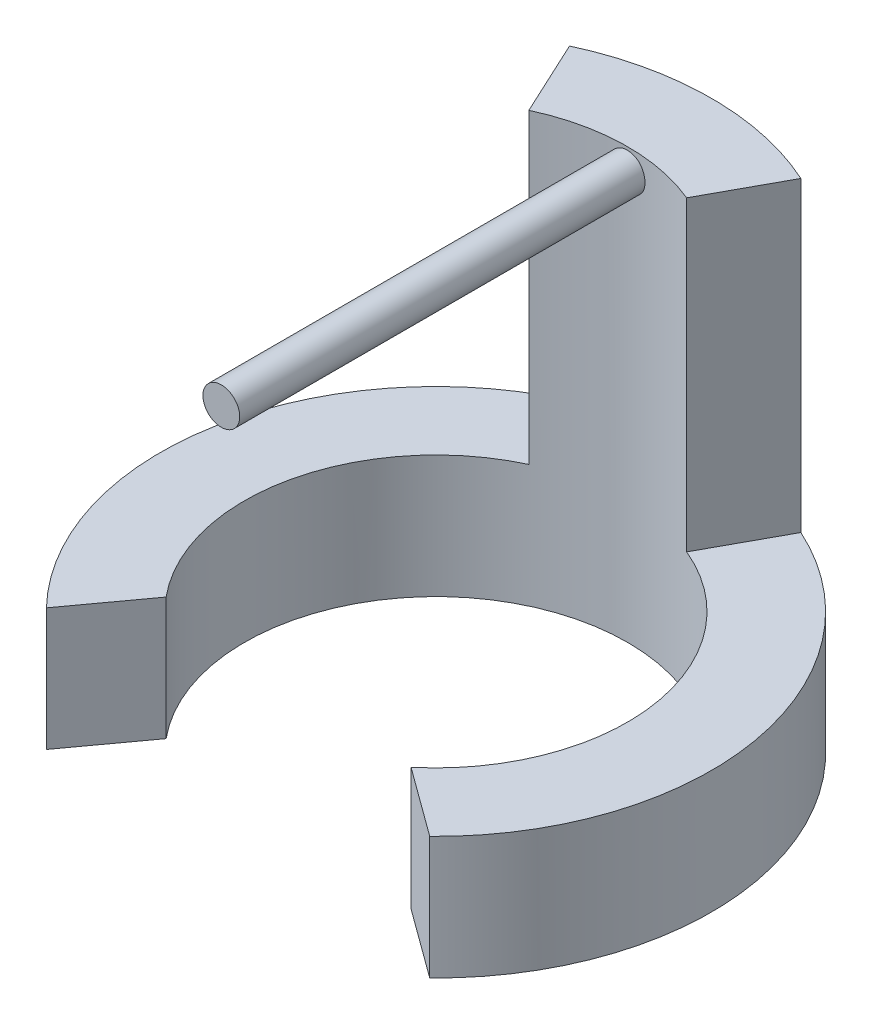
ISO-10303-21;
HEADER;
FILE_DESCRIPTION(('STEP AP214'),'2;1');
FILE_NAME('part.step','',(''),(''),'','','');
FILE_SCHEMA(('AUTOMOTIVE_DESIGN { 1 0 10303 214 1 1 1 1 }'));
ENDSEC;
DATA;
#1=APPLICATION_CONTEXT('core data for automotive mechanical design processes');
#2=APPLICATION_PROTOCOL_DEFINITION('international standard','automotive_design',2000,#1);
#3=PRODUCT_CONTEXT('',#1,'mechanical');
#4=PRODUCT('Part','Part','',(#3));
#5=PRODUCT_RELATED_PRODUCT_CATEGORY('part','',(#4));
#6=PRODUCT_DEFINITION_FORMATION('','',#4);
#7=PRODUCT_DEFINITION_CONTEXT('part definition',#1,'design');
#8=PRODUCT_DEFINITION('design','',#6,#7);
#9=PRODUCT_DEFINITION_SHAPE('','',#8);
#10=(LENGTH_UNIT() NAMED_UNIT(*) SI_UNIT(.MILLI.,.METRE.));
#11=(NAMED_UNIT(*) PLANE_ANGLE_UNIT() SI_UNIT($,.RADIAN.));
#12=(NAMED_UNIT(*) SI_UNIT($,.STERADIAN.) SOLID_ANGLE_UNIT());
#13=UNCERTAINTY_MEASURE_WITH_UNIT(LENGTH_MEASURE(1.E-05),#10,'distance_accuracy_value','');
#14=(GEOMETRIC_REPRESENTATION_CONTEXT(3) GLOBAL_UNCERTAINTY_ASSIGNED_CONTEXT((#13)) GLOBAL_UNIT_ASSIGNED_CONTEXT((#10,
#11,#12)) REPRESENTATION_CONTEXT('',''));
#15=CARTESIAN_POINT('',(0.,0.,0.));
#16=DIRECTION('',(0.,0.,1.));
#17=DIRECTION('',(1.,0.,0.));
#18=AXIS2_PLACEMENT_3D('',#15,#16,#17);
#19=CARTESIAN_POINT('',(0.,33.782,-17.78));
#20=DIRECTION('',(0.,0.,1.));
#21=DIRECTION('',(1.,0.,0.));
#22=AXIS2_PLACEMENT_3D('',#19,#20,#21);
#23=CYLINDRICAL_SURFACE('',#22,1.524);
#24=CARTESIAN_POINT('',(0.,33.782,-17.78));
#25=DIRECTION('',(0.,0.,1.));
#26=DIRECTION('',(1.,0.,0.));
#27=AXIS2_PLACEMENT_3D('',#24,#25,#26);
#28=CIRCLE('',#27,1.524);
#29=CARTESIAN_POINT('',(1.524,33.782,-17.78));
#30=VERTEX_POINT('',#29);
#31=EDGE_CURVE('E11',#30,#30,#28,.T.);
#32=ORIENTED_EDGE('',*,*,#31,.T.);
#33=EDGE_LOOP('',(#32));
#34=FACE_BOUND('',#33,.T.);
#35=CARTESIAN_POINT('',(0.,33.782,17.78));
#36=DIRECTION('',(0.,0.,1.));
#37=DIRECTION('',(1.,0.,0.));
#38=AXIS2_PLACEMENT_3D('',#35,#36,#37);
#39=CIRCLE('',#38,1.524);
#40=CARTESIAN_POINT('',(1.524,33.782,17.78));
#41=VERTEX_POINT('',#40);
#42=EDGE_CURVE('E47',#41,#41,#39,.T.);
#43=ORIENTED_EDGE('',*,*,#42,.F.);
#44=EDGE_LOOP('',(#43));
#45=FACE_BOUND('',#44,.T.);
#46=ADVANCED_FACE('F41',(#34,#45),#23,.T.);
#47=CARTESIAN_POINT('',(0.,33.782,-17.78));
#48=DIRECTION('',(0.,0.,1.));
#49=DIRECTION('',(1.,0.,0.));
#50=AXIS2_PLACEMENT_3D('',#47,#48,#49);
#51=PLANE('',#50);
#52=ORIENTED_EDGE('',*,*,#31,.F.);
#53=EDGE_LOOP('',(#52));
#54=FACE_BOUND('',#53,.T.);
#55=ADVANCED_FACE('F56',(#54),#51,.F.);
#56=CARTESIAN_POINT('',(0.,33.782,17.78));
#57=DIRECTION('',(0.,0.,1.));
#58=DIRECTION('',(1.,0.,0.));
#59=AXIS2_PLACEMENT_3D('',#56,#57,#58);
#60=PLANE('',#59);
#61=ORIENTED_EDGE('',*,*,#42,.T.);
#62=EDGE_LOOP('',(#61));
#63=FACE_BOUND('',#62,.T.);
#64=ADVANCED_FACE('F53',(#63),#60,.T.);
#65=CLOSED_SHELL('',(#46,#55,#64));
#66=MANIFOLD_SOLID_BREP('B2',#65);
#67=CARTESIAN_POINT('',(0.,10.16,0.));
#68=DIRECTION('',(0.,1.,0.));
#69=DIRECTION('',(0.,0.,1.));
#70=AXIS2_PLACEMENT_3D('',#67,#68,#69);
#71=PLANE('',#70);
#72=DIRECTION('',(0.478997940383558,0.,-0.877816024636318));
#73=VECTOR('',#72,1.);
#74=CARTESIAN_POINT('',(9.45080087432411,10.16,-20.7705174006347));
#75=LINE('',#74,#73);
#76=CARTESIAN_POINT('',(6.11175472555873,10.16,-14.6513507628003));
#77=VERTEX_POINT('',#76);
#78=CARTESIAN_POINT('',(9.45080087432412,10.16,-20.7705174006347));
#79=VERTEX_POINT('',#78);
#80=EDGE_CURVE('E168',#77,#79,#75,.T.);
#81=ORIENTED_EDGE('',*,*,#80,.F.);
#82=CARTESIAN_POINT('',(0.,10.16,0.));
#83=DIRECTION('',(0.,-1.,0.));
#84=DIRECTION('',(0.,0.,1.));
#85=AXIS2_PLACEMENT_3D('',#82,#83,#84);
#86=CIRCLE('',#85,15.875);
#87=CARTESIAN_POINT('',(10.1444376507506,10.16,12.2108971721997));
#88=VERTEX_POINT('',#87);
#89=EDGE_CURVE('E200',#77,#88,#86,.T.);
#90=ORIENTED_EDGE('',*,*,#89,.T.);
#91=DIRECTION('',(0.807796803399362,0.,0.589461045716994));
#92=VECTOR('',#91,1.);
#93=CARTESIAN_POINT('',(10.1444376507506,10.16,12.2108971721997));
#94=LINE('',#93,#92);
#95=CARTESIAN_POINT('',(15.875,10.16,16.3925716486522));
#96=VERTEX_POINT('',#95);
#97=EDGE_CURVE('E196',#88,#96,#94,.T.);
#98=ORIENTED_EDGE('',*,*,#97,.T.);
#99=CARTESIAN_POINT('',(0.,10.16,0.));
#100=DIRECTION('',(0.,1.,0.));
#101=DIRECTION('',(0.,0.,1.));
#102=AXIS2_PLACEMENT_3D('',#99,#100,#101);
#103=CIRCLE('',#102,22.8195536822304);
#104=EDGE_CURVE('E107',#96,#79,#103,.T.);
#105=ORIENTED_EDGE('',*,*,#104,.T.);
#106=EDGE_LOOP('',(#81,#90,#98,#105));
#107=FACE_BOUND('',#106,.T.);
#108=ADVANCED_FACE('F82',(#107),#71,.T.);
#109=CARTESIAN_POINT('',(0.,10.16,0.));
#110=DIRECTION('',(0.,-1.,0.));
#111=DIRECTION('',(0.,0.,-1.));
#112=AXIS2_PLACEMENT_3D('',#109,#110,#111);
#113=CYLINDRICAL_SURFACE('',#112,15.875);
#114=CARTESIAN_POINT('',(0.,0.,0.));
#115=DIRECTION('',(0.,-1.,0.));
#116=DIRECTION('',(0.,0.,1.));
#117=AXIS2_PLACEMENT_3D('',#114,#115,#116);
#118=CIRCLE('',#117,15.875);
#119=CARTESIAN_POINT('',(-12.2108971721997,0.,10.1444376507506));
#120=VERTEX_POINT('',#119);
#121=CARTESIAN_POINT('',(10.1444376507506,0.,12.2108971721997));
#122=VERTEX_POINT('',#121);
#123=EDGE_CURVE('E173',#120,#122,#118,.T.);
#124=ORIENTED_EDGE('',*,*,#123,.T.);
#125=DIRECTION('',(0.,-1.,0.));
#126=VECTOR('',#125,1.);
#127=CARTESIAN_POINT('',(10.1444376507506,10.16,12.2108971721997));
#128=LINE('',#127,#126);
#129=EDGE_CURVE('E39',#88,#122,#128,.T.);
#130=ORIENTED_EDGE('',*,*,#129,.F.);
#131=ORIENTED_EDGE('',*,*,#89,.F.);
#132=DIRECTION('',(0.,-1.,0.));
#133=VECTOR('',#132,1.);
#134=CARTESIAN_POINT('',(6.11175472555873,35.56,-14.6513507628003));
#135=LINE('',#134,#133);
#136=CARTESIAN_POINT('',(6.11175472555873,35.56,-14.6513507628003));
#137=VERTEX_POINT('',#136);
#138=EDGE_CURVE('E178',#137,#77,#135,.T.);
#139=ORIENTED_EDGE('',*,*,#138,.F.);
#140=CARTESIAN_POINT('',(0.,35.56,0.));
#141=DIRECTION('',(0.,-1.,0.));
#142=DIRECTION('',(0.,0.,-1.));
#143=AXIS2_PLACEMENT_3D('',#140,#141,#142);
#144=CIRCLE('',#143,15.875);
#145=CARTESIAN_POINT('',(-6.698472134053,35.56,-14.3925708637934));
#146=VERTEX_POINT('',#145);
#147=EDGE_CURVE('E158',#146,#137,#144,.T.);
#148=ORIENTED_EDGE('',*,*,#147,.F.);
#149=DIRECTION('',(0.,-1.,0.));
#150=VECTOR('',#149,1.);
#151=CARTESIAN_POINT('',(-6.698472134053,35.56,-14.3925708637934));
#152=LINE('',#151,#150);
#153=CARTESIAN_POINT('',(-6.698472134053,10.16,-14.3925708637934));
#154=VERTEX_POINT('',#153);
#155=EDGE_CURVE('E155',#146,#154,#152,.T.);
#156=ORIENTED_EDGE('',*,*,#155,.T.);
#157=CARTESIAN_POINT('',(-12.2108971721997,10.16,10.1444376507506));
#158=VERTEX_POINT('',#157);
#159=EDGE_CURVE('E203',#158,#154,#86,.T.);
#160=ORIENTED_EDGE('',*,*,#159,.F.);
#161=DIRECTION('',(0.,-1.,0.));
#162=VECTOR('',#161,1.);
#163=CARTESIAN_POINT('',(-12.2108971721997,10.16,10.1444376507506));
#164=LINE('',#163,#162);
#165=EDGE_CURVE('E210',#158,#120,#164,.T.);
#166=ORIENTED_EDGE('',*,*,#165,.T.);
#167=EDGE_LOOP('',(#124,#130,#131,#139,#148,#156,#160,#166));
#168=FACE_BOUND('',#167,.T.);
#169=ADVANCED_FACE('F84',(#168),#113,.F.);
#170=CARTESIAN_POINT('',(10.1444376507506,10.16,12.2108971721997));
#171=DIRECTION('',(0.589461045716994,0.,-0.807796803399362));
#172=DIRECTION('',(-0.807796803399362,0.,-0.589461045716994));
#173=AXIS2_PLACEMENT_3D('',#170,#171,#172);
#174=PLANE('',#173);
#175=DIRECTION('',(0.807796803399362,0.,0.589461045716994));
#176=VECTOR('',#175,1.);
#177=CARTESIAN_POINT('',(10.1444376507506,0.,12.2108971721997));
#178=LINE('',#177,#176);
#179=CARTESIAN_POINT('',(15.875,0.,16.3925716486522));
#180=VERTEX_POINT('',#179);
#181=EDGE_CURVE('E176',#122,#180,#178,.T.);
#182=ORIENTED_EDGE('',*,*,#181,.T.);
#183=DIRECTION('',(0.,-1.,0.));
#184=VECTOR('',#183,1.);
#185=CARTESIAN_POINT('',(15.875,10.16,16.3925716486522));
#186=LINE('',#185,#184);
#187=EDGE_CURVE('E91',#96,#180,#186,.T.);
#188=ORIENTED_EDGE('',*,*,#187,.F.);
#189=ORIENTED_EDGE('',*,*,#97,.F.);
#190=ORIENTED_EDGE('',*,*,#129,.T.);
#191=EDGE_LOOP('',(#182,#188,#189,#190));
#192=FACE_BOUND('',#191,.T.);
#193=ADVANCED_FACE('F228',(#192),#174,.F.);
#194=CARTESIAN_POINT('',(0.,10.16,0.));
#195=DIRECTION('',(0.,-1.,0.));
#196=DIRECTION('',(0.,0.,-1.));
#197=AXIS2_PLACEMENT_3D('',#194,#195,#196);
#198=CYLINDRICAL_SURFACE('',#197,22.8195536822304);
#199=CARTESIAN_POINT('',(0.,0.,0.));
#200=DIRECTION('',(0.,1.,0.));
#201=DIRECTION('',(0.,0.,1.));
#202=AXIS2_PLACEMENT_3D('',#199,#200,#201);
#203=CIRCLE('',#202,22.8195536822304);
#204=CARTESIAN_POINT('',(-16.3925716486522,0.,15.875));
#205=VERTEX_POINT('',#204);
#206=EDGE_CURVE('E216',#180,#205,#203,.T.);
#207=ORIENTED_EDGE('',*,*,#206,.T.);
#208=DIRECTION('',(0.,-1.,0.));
#209=VECTOR('',#208,1.);
#210=CARTESIAN_POINT('',(-16.3925716486522,10.16,15.875));
#211=LINE('',#210,#209);
#212=CARTESIAN_POINT('',(-16.3925716486522,10.16,15.875));
#213=VERTEX_POINT('',#212);
#214=EDGE_CURVE('E207',#213,#205,#211,.T.);
#215=ORIENTED_EDGE('',*,*,#214,.F.);
#216=CARTESIAN_POINT('',(-9.62873350878405,10.16,-20.688632658371));
#217=VERTEX_POINT('',#216);
#218=EDGE_CURVE('E172',#217,#213,#103,.T.);
#219=ORIENTED_EDGE('',*,*,#218,.F.);
#220=DIRECTION('',(0.,-1.,0.));
#221=VECTOR('',#220,1.);
#222=CARTESIAN_POINT('',(-9.62873350878405,35.56,-20.688632658371));
#223=LINE('',#222,#221);
#224=CARTESIAN_POINT('',(-9.62873350878405,35.56,-20.688632658371));
#225=VERTEX_POINT('',#224);
#226=EDGE_CURVE('E153',#225,#217,#223,.T.);
#227=ORIENTED_EDGE('',*,*,#226,.F.);
#228=CARTESIAN_POINT('',(0.,35.56,0.));
#229=DIRECTION('',(0.,1.,0.));
#230=DIRECTION('',(0.,0.,-1.));
#231=AXIS2_PLACEMENT_3D('',#228,#229,#230);
#232=CIRCLE('',#231,22.8195536822304);
#233=CARTESIAN_POINT('',(9.45080087432411,35.56,-20.7705174006347));
#234=VERTEX_POINT('',#233);
#235=EDGE_CURVE('E159',#234,#225,#232,.T.);
#236=ORIENTED_EDGE('',*,*,#235,.F.);
#237=DIRECTION('',(0.,-1.,0.));
#238=VECTOR('',#237,1.);
#239=CARTESIAN_POINT('',(9.45080087432411,35.56,-20.7705174006347));
#240=LINE('',#239,#238);
#241=EDGE_CURVE('E187',#234,#79,#240,.T.);
#242=ORIENTED_EDGE('',*,*,#241,.T.);
#243=ORIENTED_EDGE('',*,*,#104,.F.);
#244=ORIENTED_EDGE('',*,*,#187,.T.);
#245=EDGE_LOOP('',(#207,#215,#219,#227,#236,#242,#243,#244));
#246=FACE_BOUND('',#245,.T.);
#247=ADVANCED_FACE('F170',(#246),#198,.T.);
#248=CARTESIAN_POINT('',(-16.3925716486522,10.16,15.875));
#249=DIRECTION('',(-0.807796803399362,0.,-0.589461045716994));
#250=DIRECTION('',(-0.589461045716994,0.,0.807796803399362));
#251=AXIS2_PLACEMENT_3D('',#248,#249,#250);
#252=PLANE('',#251);
#253=DIRECTION('',(0.589461045716994,0.,-0.807796803399362));
#254=VECTOR('',#253,1.);
#255=CARTESIAN_POINT('',(-16.3925716486522,0.,15.875));
#256=LINE('',#255,#254);
#257=EDGE_CURVE('E214',#205,#120,#256,.T.);
#258=ORIENTED_EDGE('',*,*,#257,.T.);
#259=ORIENTED_EDGE('',*,*,#165,.F.);
#260=DIRECTION('',(0.589461045716994,0.,-0.807796803399362));
#261=VECTOR('',#260,1.);
#262=CARTESIAN_POINT('',(-16.3925716486522,10.16,15.875));
#263=LINE('',#262,#261);
#264=EDGE_CURVE('E213',#213,#158,#263,.T.);
#265=ORIENTED_EDGE('',*,*,#264,.F.);
#266=ORIENTED_EDGE('',*,*,#214,.T.);
#267=EDGE_LOOP('',(#258,#259,#265,#266));
#268=FACE_BOUND('',#267,.T.);
#269=ADVANCED_FACE('F253',(#268),#252,.F.);
#270=DIRECTION('',(0.421951000570268,0.,0.90661863708935));
#271=VECTOR('',#270,1.);
#272=CARTESIAN_POINT('',(-9.62873350878405,10.16,-20.688632658371));
#273=LINE('',#272,#271);
#274=EDGE_CURVE('E99',#217,#154,#273,.T.);
#275=ORIENTED_EDGE('',*,*,#274,.F.);
#276=ORIENTED_EDGE('',*,*,#218,.T.);
#277=ORIENTED_EDGE('',*,*,#264,.T.);
#278=ORIENTED_EDGE('',*,*,#159,.T.);
#279=EDGE_LOOP('',(#275,#276,#277,#278));
#280=FACE_BOUND('',#279,.T.);
#281=ADVANCED_FACE('F247',(#280),#71,.T.);
#282=CARTESIAN_POINT('',(0.,0.,0.));
#283=DIRECTION('',(0.,1.,0.));
#284=DIRECTION('',(0.,0.,1.));
#285=AXIS2_PLACEMENT_3D('',#282,#283,#284);
#286=PLANE('',#285);
#287=ORIENTED_EDGE('',*,*,#123,.F.);
#288=ORIENTED_EDGE('',*,*,#257,.F.);
#289=ORIENTED_EDGE('',*,*,#206,.F.);
#290=ORIENTED_EDGE('',*,*,#181,.F.);
#291=EDGE_LOOP('',(#287,#288,#289,#290));
#292=FACE_BOUND('',#291,.T.);
#293=ADVANCED_FACE('F243',(#292),#286,.F.);
#294=CARTESIAN_POINT('',(-9.62873350878405,35.56,-20.688632658371));
#295=DIRECTION('',(0.90661863708935,0.,-0.421951000570267));
#296=DIRECTION('',(-0.421951000570267,0.,-0.90661863708935));
#297=AXIS2_PLACEMENT_3D('',#294,#295,#296);
#298=PLANE('',#297);
#299=ORIENTED_EDGE('',*,*,#274,.T.);
#300=ORIENTED_EDGE('',*,*,#155,.F.);
#301=DIRECTION('',(0.421951000570268,0.,0.90661863708935));
#302=VECTOR('',#301,1.);
#303=CARTESIAN_POINT('',(-9.62873350878405,35.56,-20.688632658371));
#304=LINE('',#303,#302);
#305=EDGE_CURVE('E149',#225,#146,#304,.T.);
#306=ORIENTED_EDGE('',*,*,#305,.F.);
#307=ORIENTED_EDGE('',*,*,#226,.T.);
#308=EDGE_LOOP('',(#299,#300,#306,#307));
#309=FACE_BOUND('',#308,.T.);
#310=ADVANCED_FACE('F151',(#309),#298,.F.);
#311=CARTESIAN_POINT('',(9.45080087432411,35.56,-20.7705174006347));
#312=DIRECTION('',(-0.877816024636318,0.,-0.478997940383558));
#313=DIRECTION('',(-0.478997940383558,0.,0.877816024636319));
#314=AXIS2_PLACEMENT_3D('',#311,#312,#313);
#315=PLANE('',#314);
#316=ORIENTED_EDGE('',*,*,#80,.T.);
#317=ORIENTED_EDGE('',*,*,#241,.F.);
#318=DIRECTION('',(0.478997940383558,0.,-0.877816024636318));
#319=VECTOR('',#318,1.);
#320=CARTESIAN_POINT('',(9.45080087432411,35.56,-20.7705174006347));
#321=LINE('',#320,#319);
#322=EDGE_CURVE('E164',#137,#234,#321,.T.);
#323=ORIENTED_EDGE('',*,*,#322,.F.);
#324=ORIENTED_EDGE('',*,*,#138,.T.);
#325=EDGE_LOOP('',(#316,#317,#323,#324));
#326=FACE_BOUND('',#325,.T.);
#327=ADVANCED_FACE('F235',(#326),#315,.F.);
#328=CARTESIAN_POINT('',(0.,35.56,0.));
#329=DIRECTION('',(0.,-1.,0.));
#330=DIRECTION('',(0.,0.,-1.));
#331=AXIS2_PLACEMENT_3D('',#328,#329,#330);
#332=PLANE('',#331);
#333=ORIENTED_EDGE('',*,*,#235,.T.);
#334=ORIENTED_EDGE('',*,*,#305,.T.);
#335=ORIENTED_EDGE('',*,*,#147,.T.);
#336=ORIENTED_EDGE('',*,*,#322,.T.);
#337=EDGE_LOOP('',(#333,#334,#335,#336));
#338=FACE_BOUND('',#337,.T.);
#339=ADVANCED_FACE('F162',(#338),#332,.F.);
#340=CLOSED_SHELL('',(#108,#169,#193,#247,#269,#281,#293,#310,#327,#339));
#341=MANIFOLD_SOLID_BREP('B6',#340);
#342=ADVANCED_BREP_SHAPE_REPRESENTATION('',(#18,#66,#341),#14);
#343=SHAPE_DEFINITION_REPRESENTATION(#9,#342);
ENDSEC;
END-ISO-10303-21;
